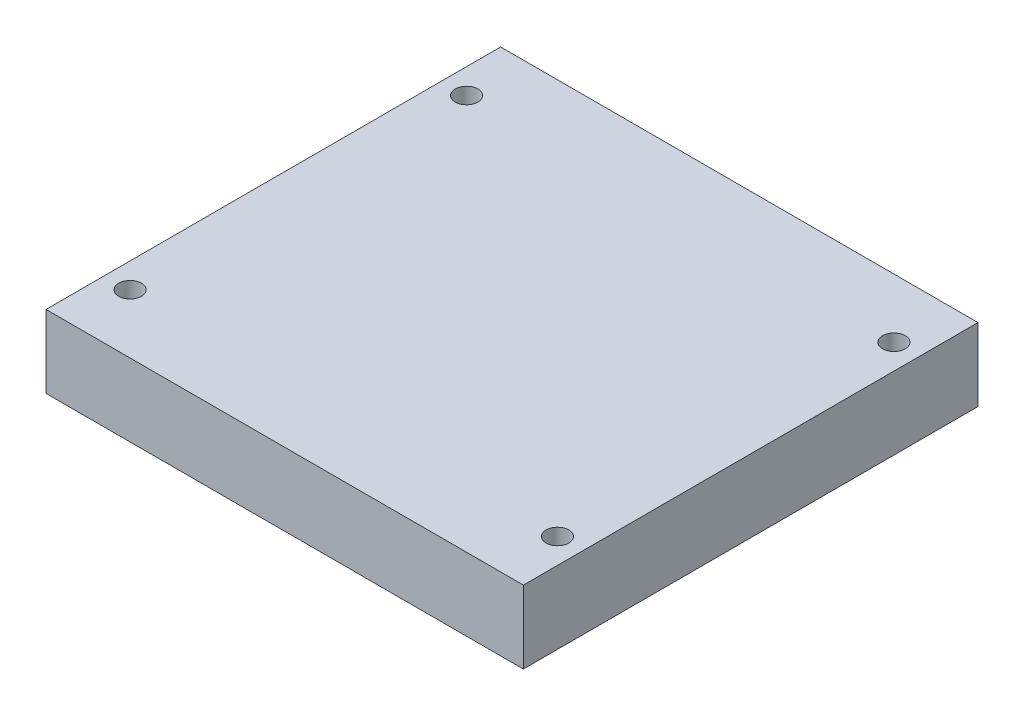
ISO-10303-21;
HEADER;
FILE_DESCRIPTION(('STEP AP214'),'2;1');
FILE_NAME('part.step','',(''),(''),'','','');
FILE_SCHEMA(('AUTOMOTIVE_DESIGN { 1 0 10303 214 1 1 1 1 }'));
ENDSEC;
DATA;
#1=APPLICATION_CONTEXT('core data for automotive mechanical design processes');
#2=APPLICATION_PROTOCOL_DEFINITION('international standard','automotive_design',2000,#1);
#3=PRODUCT_CONTEXT('',#1,'mechanical');
#4=PRODUCT('Part','Part','',(#3));
#5=PRODUCT_RELATED_PRODUCT_CATEGORY('part','',(#4));
#6=PRODUCT_DEFINITION_FORMATION('','',#4);
#7=PRODUCT_DEFINITION_CONTEXT('part definition',#1,'design');
#8=PRODUCT_DEFINITION('design','',#6,#7);
#9=PRODUCT_DEFINITION_SHAPE('','',#8);
#10=(LENGTH_UNIT() NAMED_UNIT(*) SI_UNIT(.MILLI.,.METRE.));
#11=(NAMED_UNIT(*) PLANE_ANGLE_UNIT() SI_UNIT($,.RADIAN.));
#12=(NAMED_UNIT(*) SI_UNIT($,.STERADIAN.) SOLID_ANGLE_UNIT());
#13=UNCERTAINTY_MEASURE_WITH_UNIT(LENGTH_MEASURE(1.E-05),#10,'distance_accuracy_value','');
#14=(GEOMETRIC_REPRESENTATION_CONTEXT(3) GLOBAL_UNCERTAINTY_ASSIGNED_CONTEXT((#13)) GLOBAL_UNIT_ASSIGNED_CONTEXT((#10,
#11,#12)) REPRESENTATION_CONTEXT('',''));
#15=CARTESIAN_POINT('',(0.,0.,0.));
#16=DIRECTION('',(0.,0.,1.));
#17=DIRECTION('',(1.,0.,0.));
#18=AXIS2_PLACEMENT_3D('',#15,#16,#17);
#19=CARTESIAN_POINT('',(0.,16.,0.));
#20=DIRECTION('',(0.,-1.,0.));
#21=DIRECTION('',(0.,0.,-1.));
#22=AXIS2_PLACEMENT_3D('',#19,#20,#21);
#23=PLANE('',#22);
#24=CARTESIAN_POINT('',(47.,16.,-37.));
#25=DIRECTION('',(0.,-1.,0.));
#26=DIRECTION('',(0.,0.,-1.));
#27=AXIS2_PLACEMENT_3D('',#24,#25,#26);
#28=CIRCLE('',#27,2.5);
#29=CARTESIAN_POINT('',(47.,16.,-39.5));
#30=VERTEX_POINT('',#29);
#31=EDGE_CURVE('E247',#30,#30,#28,.T.);
#32=ORIENTED_EDGE('',*,*,#31,.T.);
#33=EDGE_LOOP('',(#32));
#34=FACE_BOUND('',#33,.T.);
#35=CARTESIAN_POINT('',(-47.,16.,37.));
#36=DIRECTION('',(0.,-1.,0.));
#37=DIRECTION('',(0.,0.,-1.));
#38=AXIS2_PLACEMENT_3D('',#35,#36,#37);
#39=CIRCLE('',#38,2.5);
#40=CARTESIAN_POINT('',(-47.,16.,34.5));
#41=VERTEX_POINT('',#40);
#42=EDGE_CURVE('E257',#41,#41,#39,.T.);
#43=ORIENTED_EDGE('',*,*,#42,.T.);
#44=EDGE_LOOP('',(#43));
#45=FACE_BOUND('',#44,.T.);
#46=DIRECTION('',(-1.,0.,0.));
#47=VECTOR('',#46,1.);
#48=CARTESIAN_POINT('',(52.5,16.,50.));
#49=LINE('',#48,#47);
#50=CARTESIAN_POINT('',(52.5,16.,50.));
#51=VERTEX_POINT('',#50);
#52=CARTESIAN_POINT('',(-52.5,16.,50.));
#53=VERTEX_POINT('',#52);
#54=EDGE_CURVE('E169',#51,#53,#49,.T.);
#55=ORIENTED_EDGE('',*,*,#54,.F.);
#56=DIRECTION('',(0.,0.,-1.));
#57=VECTOR('',#56,1.);
#58=CARTESIAN_POINT('',(52.5,16.,50.));
#59=LINE('',#58,#57);
#60=CARTESIAN_POINT('',(52.5,16.,-50.));
#61=VERTEX_POINT('',#60);
#62=EDGE_CURVE('E154',#51,#61,#59,.T.);
#63=ORIENTED_EDGE('',*,*,#62,.T.);
#64=DIRECTION('',(-1.,0.,0.));
#65=VECTOR('',#64,1.);
#66=CARTESIAN_POINT('',(52.5,16.,-50.));
#67=LINE('',#66,#65);
#68=CARTESIAN_POINT('',(-52.5,16.,-50.));
#69=VERTEX_POINT('',#68);
#70=EDGE_CURVE('E149',#61,#69,#67,.T.);
#71=ORIENTED_EDGE('',*,*,#70,.T.);
#72=DIRECTION('',(0.,0.,-1.));
#73=VECTOR('',#72,1.);
#74=CARTESIAN_POINT('',(-52.5,16.,50.));
#75=LINE('',#74,#73);
#76=EDGE_CURVE('E153',#53,#69,#75,.T.);
#77=ORIENTED_EDGE('',*,*,#76,.F.);
#78=EDGE_LOOP('',(#55,#63,#71,#77));
#79=FACE_BOUND('',#78,.T.);
#80=CARTESIAN_POINT('',(47.,16.,37.));
#81=DIRECTION('',(0.,1.,0.));
#82=DIRECTION('',(0.,0.,1.));
#83=AXIS2_PLACEMENT_3D('',#80,#81,#82);
#84=CIRCLE('',#83,2.5);
#85=CARTESIAN_POINT('',(47.,16.,39.5));
#86=VERTEX_POINT('',#85);
#87=EDGE_CURVE('E182',#86,#86,#84,.T.);
#88=ORIENTED_EDGE('',*,*,#87,.F.);
#89=EDGE_LOOP('',(#88));
#90=FACE_BOUND('',#89,.T.);
#91=CARTESIAN_POINT('',(-47.,16.,-37.));
#92=DIRECTION('',(0.,1.,0.));
#93=DIRECTION('',(0.,0.,1.));
#94=AXIS2_PLACEMENT_3D('',#91,#92,#93);
#95=CIRCLE('',#94,2.5);
#96=CARTESIAN_POINT('',(-47.,16.,-34.5));
#97=VERTEX_POINT('',#96);
#98=EDGE_CURVE('E246',#97,#97,#95,.T.);
#99=ORIENTED_EDGE('',*,*,#98,.F.);
#100=EDGE_LOOP('',(#99));
#101=FACE_BOUND('',#100,.T.);
#102=ADVANCED_FACE('F101',(#34,#45,#79,#90,#101),#23,.F.);
#103=CARTESIAN_POINT('',(0.,0.,0.));
#104=DIRECTION('',(0.,-1.,0.));
#105=DIRECTION('',(0.,0.,-1.));
#106=AXIS2_PLACEMENT_3D('',#103,#104,#105);
#107=PLANE('',#106);
#108=CARTESIAN_POINT('',(0.,0.,0.));
#109=DIRECTION('',(0.,1.,0.));
#110=DIRECTION('',(0.,0.,1.));
#111=AXIS2_PLACEMENT_3D('',#108,#109,#110);
#112=CIRCLE('',#111,45.);
#113=CARTESIAN_POINT('',(0.,0.,45.));
#114=VERTEX_POINT('',#113);
#115=EDGE_CURVE('E367',#114,#114,#112,.T.);
#116=ORIENTED_EDGE('',*,*,#115,.T.);
#117=EDGE_LOOP('',(#116));
#118=FACE_BOUND('',#117,.T.);
#119=CARTESIAN_POINT('',(47.,0.,-37.));
#120=DIRECTION('',(0.,-1.,0.));
#121=DIRECTION('',(0.,0.,-1.));
#122=AXIS2_PLACEMENT_3D('',#119,#120,#121);
#123=CIRCLE('',#122,2.5);
#124=CARTESIAN_POINT('',(47.,0.,-39.5));
#125=VERTEX_POINT('',#124);
#126=EDGE_CURVE('E253',#125,#125,#123,.T.);
#127=ORIENTED_EDGE('',*,*,#126,.F.);
#128=EDGE_LOOP('',(#127));
#129=FACE_BOUND('',#128,.T.);
#130=CARTESIAN_POINT('',(47.,0.,37.));
#131=DIRECTION('',(0.,1.,0.));
#132=DIRECTION('',(0.,0.,1.));
#133=AXIS2_PLACEMENT_3D('',#130,#131,#132);
#134=CIRCLE('',#133,2.5);
#135=CARTESIAN_POINT('',(47.,0.,39.5));
#136=VERTEX_POINT('',#135);
#137=EDGE_CURVE('E261',#136,#136,#134,.T.);
#138=ORIENTED_EDGE('',*,*,#137,.T.);
#139=EDGE_LOOP('',(#138));
#140=FACE_BOUND('',#139,.T.);
#141=DIRECTION('',(-1.,0.,0.));
#142=VECTOR('',#141,1.);
#143=CARTESIAN_POINT('',(52.5,0.,50.));
#144=LINE('',#143,#142);
#145=CARTESIAN_POINT('',(52.5,0.,50.));
#146=VERTEX_POINT('',#145);
#147=CARTESIAN_POINT('',(-52.5,0.,50.));
#148=VERTEX_POINT('',#147);
#149=EDGE_CURVE('E177',#146,#148,#144,.T.);
#150=ORIENTED_EDGE('',*,*,#149,.T.);
#151=DIRECTION('',(0.,0.,-1.));
#152=VECTOR('',#151,1.);
#153=CARTESIAN_POINT('',(-52.5,0.,50.));
#154=LINE('',#153,#152);
#155=CARTESIAN_POINT('',(-52.5,0.,-50.));
#156=VERTEX_POINT('',#155);
#157=EDGE_CURVE('E181',#148,#156,#154,.T.);
#158=ORIENTED_EDGE('',*,*,#157,.T.);
#159=DIRECTION('',(-1.,0.,0.));
#160=VECTOR('',#159,1.);
#161=CARTESIAN_POINT('',(52.5,0.,-50.));
#162=LINE('',#161,#160);
#163=CARTESIAN_POINT('',(52.5,0.,-50.));
#164=VERTEX_POINT('',#163);
#165=EDGE_CURVE('E162',#164,#156,#162,.T.);
#166=ORIENTED_EDGE('',*,*,#165,.F.);
#167=DIRECTION('',(0.,0.,-1.));
#168=VECTOR('',#167,1.);
#169=CARTESIAN_POINT('',(52.5,0.,50.));
#170=LINE('',#169,#168);
#171=EDGE_CURVE('E136',#146,#164,#170,.T.);
#172=ORIENTED_EDGE('',*,*,#171,.F.);
#173=EDGE_LOOP('',(#150,#158,#166,#172));
#174=FACE_BOUND('',#173,.T.);
#175=CARTESIAN_POINT('',(-47.,0.,37.));
#176=DIRECTION('',(0.,-1.,0.));
#177=DIRECTION('',(0.,0.,-1.));
#178=AXIS2_PLACEMENT_3D('',#175,#176,#177);
#179=CIRCLE('',#178,2.5);
#180=CARTESIAN_POINT('',(-47.,0.,34.5));
#181=VERTEX_POINT('',#180);
#182=EDGE_CURVE('E240',#181,#181,#179,.T.);
#183=ORIENTED_EDGE('',*,*,#182,.F.);
#184=EDGE_LOOP('',(#183));
#185=FACE_BOUND('',#184,.T.);
#186=CARTESIAN_POINT('',(-47.,0.,-37.));
#187=DIRECTION('',(0.,1.,0.));
#188=DIRECTION('',(0.,0.,1.));
#189=AXIS2_PLACEMENT_3D('',#186,#187,#188);
#190=CIRCLE('',#189,2.5);
#191=CARTESIAN_POINT('',(-47.,0.,-34.5));
#192=VERTEX_POINT('',#191);
#193=EDGE_CURVE('E243',#192,#192,#190,.T.);
#194=ORIENTED_EDGE('',*,*,#193,.T.);
#195=EDGE_LOOP('',(#194));
#196=FACE_BOUND('',#195,.T.);
#197=ADVANCED_FACE('F211',(#118,#129,#140,#174,#185,#196),#107,.T.);
#198=CARTESIAN_POINT('',(52.5,16.,50.));
#199=DIRECTION('',(0.,0.,1.));
#200=DIRECTION('',(1.,0.,0.));
#201=AXIS2_PLACEMENT_3D('',#198,#199,#200);
#202=PLANE('',#201);
#203=ORIENTED_EDGE('',*,*,#149,.F.);
#204=DIRECTION('',(0.,-1.,0.));
#205=VECTOR('',#204,1.);
#206=CARTESIAN_POINT('',(52.5,16.,50.));
#207=LINE('',#206,#205);
#208=EDGE_CURVE('E119',#51,#146,#207,.T.);
#209=ORIENTED_EDGE('',*,*,#208,.F.);
#210=ORIENTED_EDGE('',*,*,#54,.T.);
#211=DIRECTION('',(0.,-1.,0.));
#212=VECTOR('',#211,1.);
#213=CARTESIAN_POINT('',(-52.5,16.,50.));
#214=LINE('',#213,#212);
#215=EDGE_CURVE('E144',#53,#148,#214,.T.);
#216=ORIENTED_EDGE('',*,*,#215,.T.);
#217=EDGE_LOOP('',(#203,#209,#210,#216));
#218=FACE_BOUND('',#217,.T.);
#219=ADVANCED_FACE('F217',(#218),#202,.T.);
#220=CARTESIAN_POINT('',(52.5,16.,50.));
#221=DIRECTION('',(-1.,0.,0.));
#222=DIRECTION('',(0.,0.,1.));
#223=AXIS2_PLACEMENT_3D('',#220,#221,#222);
#224=PLANE('',#223);
#225=ORIENTED_EDGE('',*,*,#171,.T.);
#226=DIRECTION('',(0.,-1.,0.));
#227=VECTOR('',#226,1.);
#228=CARTESIAN_POINT('',(52.5,16.,-50.));
#229=LINE('',#228,#227);
#230=EDGE_CURVE('E165',#61,#164,#229,.T.);
#231=ORIENTED_EDGE('',*,*,#230,.F.);
#232=ORIENTED_EDGE('',*,*,#62,.F.);
#233=ORIENTED_EDGE('',*,*,#208,.T.);
#234=EDGE_LOOP('',(#225,#231,#232,#233));
#235=FACE_BOUND('',#234,.T.);
#236=ADVANCED_FACE('F226',(#235),#224,.F.);
#237=CARTESIAN_POINT('',(52.5,16.,-50.));
#238=DIRECTION('',(0.,0.,1.));
#239=DIRECTION('',(1.,0.,0.));
#240=AXIS2_PLACEMENT_3D('',#237,#238,#239);
#241=PLANE('',#240);
#242=ORIENTED_EDGE('',*,*,#165,.T.);
#243=DIRECTION('',(0.,-1.,0.));
#244=VECTOR('',#243,1.);
#245=CARTESIAN_POINT('',(-52.5,16.,-50.));
#246=LINE('',#245,#244);
#247=EDGE_CURVE('E159',#69,#156,#246,.T.);
#248=ORIENTED_EDGE('',*,*,#247,.F.);
#249=ORIENTED_EDGE('',*,*,#70,.F.);
#250=ORIENTED_EDGE('',*,*,#230,.T.);
#251=EDGE_LOOP('',(#242,#248,#249,#250));
#252=FACE_BOUND('',#251,.T.);
#253=ADVANCED_FACE('F160',(#252),#241,.F.);
#254=CARTESIAN_POINT('',(-52.5,16.,50.));
#255=DIRECTION('',(-1.,0.,0.));
#256=DIRECTION('',(0.,0.,1.));
#257=AXIS2_PLACEMENT_3D('',#254,#255,#256);
#258=PLANE('',#257);
#259=ORIENTED_EDGE('',*,*,#157,.F.);
#260=ORIENTED_EDGE('',*,*,#215,.F.);
#261=ORIENTED_EDGE('',*,*,#76,.T.);
#262=ORIENTED_EDGE('',*,*,#247,.T.);
#263=EDGE_LOOP('',(#259,#260,#261,#262));
#264=FACE_BOUND('',#263,.T.);
#265=ADVANCED_FACE('F167',(#264),#258,.T.);
#266=CARTESIAN_POINT('',(47.,16.,37.));
#267=DIRECTION('',(0.,-1.,0.));
#268=DIRECTION('',(0.,0.,-1.));
#269=AXIS2_PLACEMENT_3D('',#266,#267,#268);
#270=CYLINDRICAL_SURFACE('',#269,2.5);
#271=ORIENTED_EDGE('',*,*,#87,.T.);
#272=EDGE_LOOP('',(#271));
#273=FACE_BOUND('',#272,.T.);
#274=ORIENTED_EDGE('',*,*,#137,.F.);
#275=EDGE_LOOP('',(#274));
#276=FACE_BOUND('',#275,.T.);
#277=ADVANCED_FACE('F223',(#273,#276),#270,.F.);
#278=CARTESIAN_POINT('',(-47.,16.,37.));
#279=DIRECTION('',(0.,-1.,0.));
#280=DIRECTION('',(0.,0.,-1.));
#281=AXIS2_PLACEMENT_3D('',#278,#279,#280);
#282=CYLINDRICAL_SURFACE('',#281,2.5);
#283=ORIENTED_EDGE('',*,*,#42,.F.);
#284=EDGE_LOOP('',(#283));
#285=FACE_BOUND('',#284,.T.);
#286=ORIENTED_EDGE('',*,*,#182,.T.);
#287=EDGE_LOOP('',(#286));
#288=FACE_BOUND('',#287,.T.);
#289=ADVANCED_FACE('F272',(#285,#288),#282,.F.);
#290=CARTESIAN_POINT('',(-47.,16.,-37.));
#291=DIRECTION('',(0.,-1.,0.));
#292=DIRECTION('',(0.,0.,-1.));
#293=AXIS2_PLACEMENT_3D('',#290,#291,#292);
#294=CYLINDRICAL_SURFACE('',#293,2.5);
#295=ORIENTED_EDGE('',*,*,#98,.T.);
#296=EDGE_LOOP('',(#295));
#297=FACE_BOUND('',#296,.T.);
#298=ORIENTED_EDGE('',*,*,#193,.F.);
#299=EDGE_LOOP('',(#298));
#300=FACE_BOUND('',#299,.T.);
#301=ADVANCED_FACE('F277',(#297,#300),#294,.F.);
#302=CARTESIAN_POINT('',(47.,16.,-37.));
#303=DIRECTION('',(0.,-1.,0.));
#304=DIRECTION('',(0.,0.,-1.));
#305=AXIS2_PLACEMENT_3D('',#302,#303,#304);
#306=CYLINDRICAL_SURFACE('',#305,2.5);
#307=ORIENTED_EDGE('',*,*,#31,.F.);
#308=EDGE_LOOP('',(#307));
#309=FACE_BOUND('',#308,.T.);
#310=ORIENTED_EDGE('',*,*,#126,.T.);
#311=EDGE_LOOP('',(#310));
#312=FACE_BOUND('',#311,.T.);
#313=ADVANCED_FACE('F284',(#309,#312),#306,.F.);
#314=CARTESIAN_POINT('',(0.,12.,0.));
#315=DIRECTION('',(0.,-1.,0.));
#316=DIRECTION('',(0.,0.,-1.));
#317=AXIS2_PLACEMENT_3D('',#314,#315,#316);
#318=CYLINDRICAL_SURFACE('',#317,45.);
#319=CARTESIAN_POINT('',(0.,6.99999999999996,0.));
#320=DIRECTION('',(0.,1.,0.));
#321=DIRECTION('',(0.,0.,1.));
#322=AXIS2_PLACEMENT_3D('',#319,#320,#321);
#323=CIRCLE('',#322,45.);
#324=CARTESIAN_POINT('',(0.,6.99999999999996,45.));
#325=VERTEX_POINT('',#324);
#326=EDGE_CURVE('E111',#325,#325,#323,.T.);
#327=ORIENTED_EDGE('',*,*,#326,.T.);
#328=EDGE_LOOP('',(#327));
#329=FACE_BOUND('',#328,.T.);
#330=ORIENTED_EDGE('',*,*,#115,.F.);
#331=EDGE_LOOP('',(#330));
#332=FACE_BOUND('',#331,.T.);
#333=ADVANCED_FACE('F198',(#329,#332),#318,.F.);
#334=CARTESIAN_POINT('',(0.,12.,0.));
#335=DIRECTION('',(0.,1.,0.));
#336=DIRECTION('',(0.,0.,1.));
#337=AXIS2_PLACEMENT_3D('',#334,#335,#336);
#338=PLANE('',#337);
#339=CARTESIAN_POINT('',(0.,12.,0.));
#340=DIRECTION('',(0.,1.,0.));
#341=DIRECTION('',(0.,0.,1.));
#342=AXIS2_PLACEMENT_3D('',#339,#340,#341);
#343=CIRCLE('',#342,40.);
#344=CARTESIAN_POINT('',(0.,12.,40.));
#345=VERTEX_POINT('',#344);
#346=EDGE_CURVE('E12',#345,#345,#343,.F.);
#347=ORIENTED_EDGE('',*,*,#346,.T.);
#348=EDGE_LOOP('',(#347));
#349=FACE_BOUND('',#348,.T.);
#350=ADVANCED_FACE('F202',(#349),#338,.F.);
#351=CARTESIAN_POINT('',(0.,6.99999999999996,0.));
#352=DIRECTION('',(0.,-1.,0.));
#353=DIRECTION('',(0.,0.,-1.));
#354=AXIS2_PLACEMENT_3D('',#351,#352,#353);
#355=CONICAL_SURFACE('',#354,45.,0.785398163397441);
#356=ORIENTED_EDGE('',*,*,#346,.F.);
#357=EDGE_LOOP('',(#356));
#358=FACE_BOUND('',#357,.T.);
#359=ORIENTED_EDGE('',*,*,#326,.F.);
#360=EDGE_LOOP('',(#359));
#361=FACE_BOUND('',#360,.T.);
#362=ADVANCED_FACE('F103',(#358,#361),#355,.F.);
#363=CLOSED_SHELL('',(#102,#197,#219,#236,#253,#265,#277,#289,#301,#313,#333,#350,#362));
#364=MANIFOLD_SOLID_BREP('B2',#363);
#365=ADVANCED_BREP_SHAPE_REPRESENTATION('',(#18,#364),#14);
#366=SHAPE_DEFINITION_REPRESENTATION(#9,#365);
ENDSEC;
END-ISO-10303-21;
